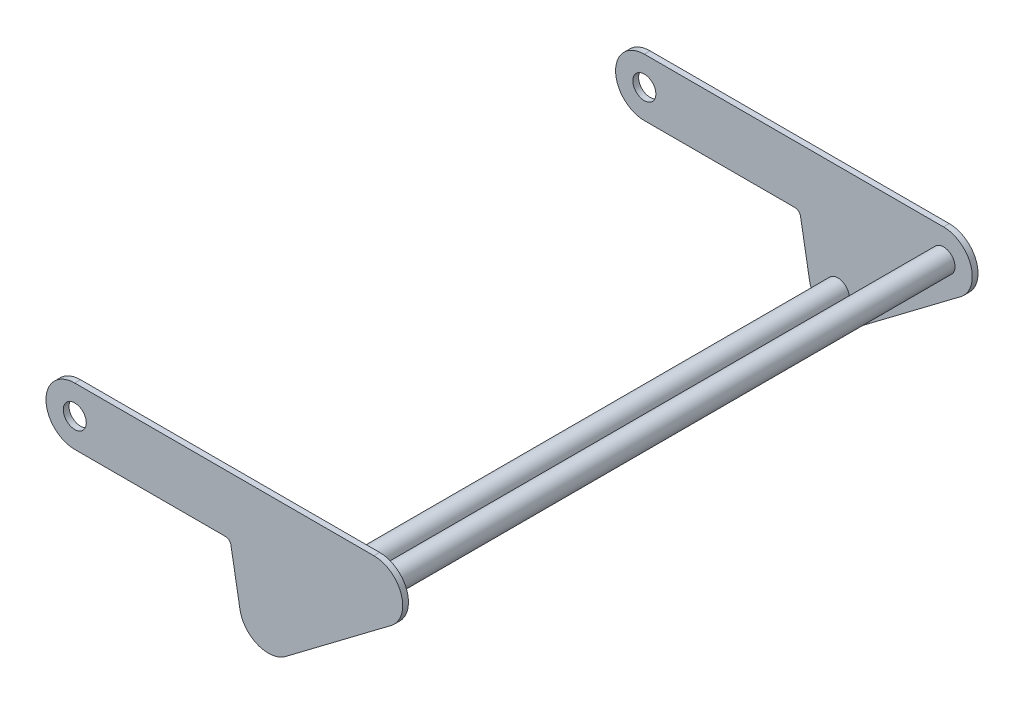
ISO-10303-21;
HEADER;
FILE_DESCRIPTION(('STEP AP214'),'2;1');
FILE_NAME('part.step','',(''),(''),'','','');
FILE_SCHEMA(('AUTOMOTIVE_DESIGN { 1 0 10303 214 1 1 1 1 }'));
ENDSEC;
DATA;
#1=APPLICATION_CONTEXT('core data for automotive mechanical design processes');
#2=APPLICATION_PROTOCOL_DEFINITION('international standard','automotive_design',2000,#1);
#3=PRODUCT_CONTEXT('',#1,'mechanical');
#4=PRODUCT('Part','Part','',(#3));
#5=PRODUCT_RELATED_PRODUCT_CATEGORY('part','',(#4));
#6=PRODUCT_DEFINITION_FORMATION('','',#4);
#7=PRODUCT_DEFINITION_CONTEXT('part definition',#1,'design');
#8=PRODUCT_DEFINITION('design','',#6,#7);
#9=PRODUCT_DEFINITION_SHAPE('','',#8);
#10=(LENGTH_UNIT() NAMED_UNIT(*) SI_UNIT(.MILLI.,.METRE.));
#11=(NAMED_UNIT(*) PLANE_ANGLE_UNIT() SI_UNIT($,.RADIAN.));
#12=(NAMED_UNIT(*) SI_UNIT($,.STERADIAN.) SOLID_ANGLE_UNIT());
#13=UNCERTAINTY_MEASURE_WITH_UNIT(LENGTH_MEASURE(1.E-05),#10,'distance_accuracy_value','');
#14=(GEOMETRIC_REPRESENTATION_CONTEXT(3) GLOBAL_UNCERTAINTY_ASSIGNED_CONTEXT((#13)) GLOBAL_UNIT_ASSIGNED_CONTEXT((#10,
#11,#12)) REPRESENTATION_CONTEXT('',''));
#15=CARTESIAN_POINT('',(0.,0.,0.));
#16=DIRECTION('',(0.,0.,1.));
#17=DIRECTION('',(1.,0.,0.));
#18=AXIS2_PLACEMENT_3D('',#15,#16,#17);
#19=CARTESIAN_POINT('',(0.,31.75,317.5));
#20=DIRECTION('',(0.,0.,-1.));
#21=DIRECTION('',(-1.,0.,0.));
#22=AXIS2_PLACEMENT_3D('',#19,#20,#21);
#23=CYLINDRICAL_SURFACE('',#22,31.75);
#24=CARTESIAN_POINT('',(0.,31.75,-311.15));
#25=DIRECTION('',(0.,0.,-1.));
#26=DIRECTION('',(-1.,0.,0.));
#27=AXIS2_PLACEMENT_3D('',#24,#25,#26);
#28=CIRCLE('',#27,31.75);
#29=CARTESIAN_POINT('',(0.,0.,-311.15));
#30=VERTEX_POINT('',#29);
#31=CARTESIAN_POINT('',(0.,63.5,-311.15));
#32=VERTEX_POINT('',#31);
#33=EDGE_CURVE('E69',#30,#32,#28,.T.);
#34=ORIENTED_EDGE('',*,*,#33,.T.);
#35=DIRECTION('',(0.,0.,-1.));
#36=VECTOR('',#35,1.);
#37=CARTESIAN_POINT('',(0.,63.5,317.5));
#38=LINE('',#37,#36);
#39=CARTESIAN_POINT('',(0.,63.5,-317.5));
#40=VERTEX_POINT('',#39);
#41=EDGE_CURVE('E55',#32,#40,#38,.T.);
#42=ORIENTED_EDGE('',*,*,#41,.T.);
#43=CARTESIAN_POINT('',(0.,31.75,-317.5));
#44=DIRECTION('',(0.,0.,1.));
#45=DIRECTION('',(1.,0.,0.));
#46=AXIS2_PLACEMENT_3D('',#43,#44,#45);
#47=CIRCLE('',#46,31.75);
#48=CARTESIAN_POINT('',(0.,0.,-317.5));
#49=VERTEX_POINT('',#48);
#50=EDGE_CURVE('E189',#40,#49,#47,.T.);
#51=ORIENTED_EDGE('',*,*,#50,.T.);
#52=DIRECTION('',(0.,0.,-1.));
#53=VECTOR('',#52,1.);
#54=CARTESIAN_POINT('',(0.,0.,317.5));
#55=LINE('',#54,#53);
#56=EDGE_CURVE('E188',#30,#49,#55,.T.);
#57=ORIENTED_EDGE('',*,*,#56,.F.);
#58=EDGE_LOOP('',(#34,#42,#51,#57));
#59=FACE_BOUND('',#58,.T.);
#60=ADVANCED_FACE('F51',(#59),#23,.T.);
#61=CARTESIAN_POINT('',(0.,0.,317.5));
#62=DIRECTION('',(0.,1.,0.));
#63=DIRECTION('',(0.,0.,1.));
#64=AXIS2_PLACEMENT_3D('',#61,#62,#63);
#65=PLANE('',#64);
#66=DIRECTION('',(0.,0.,-1.));
#67=VECTOR('',#66,1.);
#68=CARTESIAN_POINT('',(166.121717342024,0.,317.5));
#69=LINE('',#68,#67);
#70=CARTESIAN_POINT('',(166.121717342024,0.,-311.15));
#71=VERTEX_POINT('',#70);
#72=CARTESIAN_POINT('',(166.121717342024,0.,-317.5));
#73=VERTEX_POINT('',#72);
#74=EDGE_CURVE('E182',#71,#73,#69,.T.);
#75=ORIENTED_EDGE('',*,*,#74,.F.);
#76=DIRECTION('',(-1.,0.,0.));
#77=VECTOR('',#76,1.);
#78=CARTESIAN_POINT('',(1.77277547480469E-13,0.,-311.15));
#79=LINE('',#78,#77);
#80=EDGE_CURVE('E193',#71,#30,#79,.T.);
#81=ORIENTED_EDGE('',*,*,#80,.T.);
#82=ORIENTED_EDGE('',*,*,#56,.T.);
#83=DIRECTION('',(1.,0.,0.));
#84=VECTOR('',#83,1.);
#85=CARTESIAN_POINT('',(0.,0.,-317.5));
#86=LINE('',#85,#84);
#87=EDGE_CURVE('E183',#49,#73,#86,.T.);
#88=ORIENTED_EDGE('',*,*,#87,.T.);
#89=EDGE_LOOP('',(#75,#81,#82,#88));
#90=FACE_BOUND('',#89,.T.);
#91=ADVANCED_FACE('F368',(#90),#65,.F.);
#92=CARTESIAN_POINT('',(166.121717342024,-6.35,317.5));
#93=DIRECTION('',(0.,0.,-1.));
#94=DIRECTION('',(-1.,0.,0.));
#95=AXIS2_PLACEMENT_3D('',#92,#93,#94);
#96=CYLINDRICAL_SURFACE('',#95,6.34999999999999);
#97=DIRECTION('',(0.,0.,-1.));
#98=VECTOR('',#97,1.);
#99=CARTESIAN_POINT('',(172.375246573652,-5.24733407181497,317.5));
#100=LINE('',#99,#98);
#101=CARTESIAN_POINT('',(172.375246573652,-5.24733407181497,-311.15));
#102=VERTEX_POINT('',#101);
#103=CARTESIAN_POINT('',(172.375246573652,-5.24733407181497,-317.5));
#104=VERTEX_POINT('',#103);
#105=EDGE_CURVE('E177',#102,#104,#100,.T.);
#106=ORIENTED_EDGE('',*,*,#105,.F.);
#107=CARTESIAN_POINT('',(166.121717342024,-6.35,-311.15));
#108=DIRECTION('',(0.,0.,-1.));
#109=DIRECTION('',(-1.,0.,0.));
#110=AXIS2_PLACEMENT_3D('',#107,#108,#109);
#111=CIRCLE('',#110,6.34999999999999);
#112=EDGE_CURVE('E187',#102,#71,#111,.F.);
#113=ORIENTED_EDGE('',*,*,#112,.T.);
#114=ORIENTED_EDGE('',*,*,#74,.T.);
#115=CARTESIAN_POINT('',(166.121717342024,-6.35,-317.5));
#116=DIRECTION('',(0.,0.,-1.));
#117=DIRECTION('',(-1.,0.,0.));
#118=AXIS2_PLACEMENT_3D('',#115,#116,#117);
#119=CIRCLE('',#118,6.34999999999999);
#120=EDGE_CURVE('E178',#73,#104,#119,.T.);
#121=ORIENTED_EDGE('',*,*,#120,.T.);
#122=EDGE_LOOP('',(#106,#113,#114,#121));
#123=FACE_BOUND('',#122,.T.);
#124=ADVANCED_FACE('F220',(#123),#96,.F.);
#125=CARTESIAN_POINT('',(182.331323932564,-61.7110545921189,317.5));
#126=DIRECTION('',(0.984807753012207,0.173648177666934,0.));
#127=DIRECTION('',(-0.173648177666934,0.984807753012208,0.));
#128=AXIS2_PLACEMENT_3D('',#125,#126,#127);
#129=PLANE('',#128);
#130=DIRECTION('',(0.,0.,-1.));
#131=VECTOR('',#130,1.);
#132=CARTESIAN_POINT('',(182.331323932564,-61.7110545921189,317.5));
#133=LINE('',#132,#131);
#134=CARTESIAN_POINT('',(182.331323932564,-61.7110545921189,-311.15));
#135=VERTEX_POINT('',#134);
#136=CARTESIAN_POINT('',(182.331323932564,-61.7110545921189,-317.5));
#137=VERTEX_POINT('',#136);
#138=EDGE_CURVE('E130',#135,#137,#133,.T.);
#139=ORIENTED_EDGE('',*,*,#138,.F.);
#140=DIRECTION('',(-0.173648177666934,0.984807753012208,0.));
#141=VECTOR('',#140,1.);
#142=CARTESIAN_POINT('',(182.331323932564,-61.7110545921189,-311.15));
#143=LINE('',#142,#141);
#144=EDGE_CURVE('E125',#135,#102,#143,.T.);
#145=ORIENTED_EDGE('',*,*,#144,.T.);
#146=ORIENTED_EDGE('',*,*,#105,.T.);
#147=DIRECTION('',(0.173648177666934,-0.984807753012207,0.));
#148=VECTOR('',#147,1.);
#149=CARTESIAN_POINT('',(182.331323932564,-61.7110545921189,-317.5));
#150=LINE('',#149,#148);
#151=EDGE_CURVE('E140',#104,#137,#150,.T.);
#152=ORIENTED_EDGE('',*,*,#151,.T.);
#153=EDGE_LOOP('',(#139,#145,#146,#152));
#154=FACE_BOUND('',#153,.T.);
#155=ADVANCED_FACE('F216',(#154),#129,.F.);
#156=CARTESIAN_POINT('',(349.319070641564,6.40195001971773,317.5));
#157=DIRECTION('',(-0.602175453277602,0.79836377890653,0.));
#158=DIRECTION('',(-0.79836377890653,-0.602175453277602,0.));
#159=AXIS2_PLACEMENT_3D('',#156,#157,#158);
#160=PLANE('',#159);
#161=DIRECTION('',(0.,0.,-1.));
#162=VECTOR('',#161,1.);
#163=CARTESIAN_POINT('',(349.319070641564,6.40195001971773,317.5));
#164=LINE('',#163,#162);
#165=CARTESIAN_POINT('',(349.319070641564,6.40195001971773,-311.15));
#166=VERTEX_POINT('',#165);
#167=CARTESIAN_POINT('',(349.319070641564,6.40195001971773,-317.5));
#168=VERTEX_POINT('',#167);
#169=EDGE_CURVE('E138',#166,#168,#164,.T.);
#170=ORIENTED_EDGE('',*,*,#169,.F.);
#171=DIRECTION('',(-0.79836377890653,-0.602175453277602,0.));
#172=VECTOR('',#171,1.);
#173=CARTESIAN_POINT('',(349.319070641564,6.40195001971782,-311.15));
#174=LINE('',#173,#172);
#175=CARTESIAN_POINT('',(232.718040732265,-81.5457749314761,-311.15));
#176=VERTEX_POINT('',#175);
#177=EDGE_CURVE('E122',#166,#176,#174,.T.);
#178=ORIENTED_EDGE('',*,*,#177,.T.);
#179=DIRECTION('',(0.,0.,-1.));
#180=VECTOR('',#179,1.);
#181=CARTESIAN_POINT('',(232.718040732265,-81.5457749314761,317.5));
#182=LINE('',#181,#180);
#183=CARTESIAN_POINT('',(232.718040732265,-81.5457749314761,-317.5));
#184=VERTEX_POINT('',#183);
#185=EDGE_CURVE('E136',#176,#184,#182,.T.);
#186=ORIENTED_EDGE('',*,*,#185,.T.);
#187=DIRECTION('',(0.79836377890653,0.602175453277602,0.));
#188=VECTOR('',#187,1.);
#189=CARTESIAN_POINT('',(349.319070641564,6.40195001971773,-317.5));
#190=LINE('',#189,#188);
#191=EDGE_CURVE('E147',#184,#168,#190,.T.);
#192=ORIENTED_EDGE('',*,*,#191,.T.);
#193=EDGE_LOOP('',(#170,#178,#186,#192));
#194=FACE_BOUND('',#193,.T.);
#195=ADVANCED_FACE('F134',(#194),#160,.F.);
#196=CARTESIAN_POINT('',(330.2,31.75,317.5));
#197=DIRECTION('',(0.,0.,-1.));
#198=DIRECTION('',(-1.,0.,0.));
#199=AXIS2_PLACEMENT_3D('',#196,#197,#198);
#200=CYLINDRICAL_SURFACE('',#199,31.75);
#201=DIRECTION('',(0.,0.,-1.));
#202=VECTOR('',#201,1.);
#203=CARTESIAN_POINT('',(330.2,63.5,317.5));
#204=LINE('',#203,#202);
#205=CARTESIAN_POINT('',(330.2,63.5,-311.15));
#206=VERTEX_POINT('',#205);
#207=CARTESIAN_POINT('',(330.2,63.5,-317.5));
#208=VERTEX_POINT('',#207);
#209=EDGE_CURVE('E156',#206,#208,#204,.T.);
#210=ORIENTED_EDGE('',*,*,#209,.F.);
#211=CARTESIAN_POINT('',(330.2,31.75,-311.15));
#212=DIRECTION('',(0.,0.,-1.));
#213=DIRECTION('',(-1.,0.,0.));
#214=AXIS2_PLACEMENT_3D('',#211,#212,#213);
#215=CIRCLE('',#214,31.75);
#216=EDGE_CURVE('E76',#206,#166,#215,.T.);
#217=ORIENTED_EDGE('',*,*,#216,.T.);
#218=ORIENTED_EDGE('',*,*,#169,.T.);
#219=CARTESIAN_POINT('',(330.2,31.75,-317.5));
#220=DIRECTION('',(0.,0.,1.));
#221=DIRECTION('',(-1.,0.,0.));
#222=AXIS2_PLACEMENT_3D('',#219,#220,#221);
#223=CIRCLE('',#222,31.75);
#224=EDGE_CURVE('E155',#168,#208,#223,.T.);
#225=ORIENTED_EDGE('',*,*,#224,.T.);
#226=EDGE_LOOP('',(#210,#217,#218,#225));
#227=FACE_BOUND('',#226,.T.);
#228=ADVANCED_FACE('F381',(#227),#200,.T.);
#229=CARTESIAN_POINT('',(330.2,63.5,317.5));
#230=DIRECTION('',(0.,-1.,0.));
#231=DIRECTION('',(1.,0.,0.));
#232=AXIS2_PLACEMENT_3D('',#229,#230,#231);
#233=PLANE('',#232);
#234=ORIENTED_EDGE('',*,*,#41,.F.);
#235=DIRECTION('',(-1.,0.,0.));
#236=VECTOR('',#235,1.);
#237=CARTESIAN_POINT('',(-31.75,63.5,-311.15));
#238=LINE('',#237,#236);
#239=EDGE_CURVE('E11',#206,#32,#238,.T.);
#240=ORIENTED_EDGE('',*,*,#239,.F.);
#241=ORIENTED_EDGE('',*,*,#209,.T.);
#242=DIRECTION('',(-1.,0.,0.));
#243=VECTOR('',#242,1.);
#244=CARTESIAN_POINT('',(330.2,63.5,-317.5));
#245=LINE('',#244,#243);
#246=EDGE_CURVE('E158',#208,#40,#245,.T.);
#247=ORIENTED_EDGE('',*,*,#246,.T.);
#248=EDGE_LOOP('',(#234,#240,#241,#247));
#249=FACE_BOUND('',#248,.T.);
#250=ADVANCED_FACE('F228',(#249),#233,.F.);
#251=CARTESIAN_POINT('',(0.,31.75,317.5));
#252=DIRECTION('',(0.,0.,-1.));
#253=DIRECTION('',(-1.,0.,0.));
#254=AXIS2_PLACEMENT_3D('',#251,#252,#253);
#255=CYLINDRICAL_SURFACE('',#254,12.7);
#256=CARTESIAN_POINT('',(0.,31.75,-311.15));
#257=DIRECTION('',(0.,0.,-1.));
#258=DIRECTION('',(-1.,0.,0.));
#259=AXIS2_PLACEMENT_3D('',#256,#257,#258);
#260=CIRCLE('',#259,12.7);
#261=CARTESIAN_POINT('',(-12.7,31.75,-311.15));
#262=VERTEX_POINT('',#261);
#263=EDGE_CURVE('E61',#262,#262,#260,.T.);
#264=ORIENTED_EDGE('',*,*,#263,.F.);
#265=EDGE_LOOP('',(#264));
#266=FACE_BOUND('',#265,.T.);
#267=CARTESIAN_POINT('',(0.,31.75,-317.5));
#268=DIRECTION('',(0.,0.,1.));
#269=DIRECTION('',(1.,0.,0.));
#270=AXIS2_PLACEMENT_3D('',#267,#268,#269);
#271=CIRCLE('',#270,12.7);
#272=CARTESIAN_POINT('',(12.7,31.75,-317.5));
#273=VERTEX_POINT('',#272);
#274=EDGE_CURVE('E131',#273,#273,#271,.T.);
#275=ORIENTED_EDGE('',*,*,#274,.F.);
#276=EDGE_LOOP('',(#275));
#277=FACE_BOUND('',#276,.T.);
#278=ADVANCED_FACE('F53',(#266,#277),#255,.F.);
#279=CARTESIAN_POINT('',(0.,31.75,-317.5));
#280=DIRECTION('',(0.,0.,1.));
#281=DIRECTION('',(1.,0.,0.));
#282=AXIS2_PLACEMENT_3D('',#279,#280,#281);
#283=PLANE('',#282);
#284=ORIENTED_EDGE('',*,*,#50,.F.);
#285=ORIENTED_EDGE('',*,*,#246,.F.);
#286=ORIENTED_EDGE('',*,*,#224,.F.);
#287=ORIENTED_EDGE('',*,*,#191,.F.);
#288=CARTESIAN_POINT('',(213.598970090701,-56.1977249511938,-317.5));
#289=DIRECTION('',(0.,0.,1.));
#290=DIRECTION('',(-1.,0.,0.));
#291=AXIS2_PLACEMENT_3D('',#288,#289,#290);
#292=CIRCLE('',#291,31.75);
#293=EDGE_CURVE('E144',#137,#184,#292,.T.);
#294=ORIENTED_EDGE('',*,*,#293,.F.);
#295=ORIENTED_EDGE('',*,*,#151,.F.);
#296=ORIENTED_EDGE('',*,*,#120,.F.);
#297=ORIENTED_EDGE('',*,*,#87,.F.);
#298=EDGE_LOOP('',(#284,#285,#286,#287,#294,#295,#296,#297));
#299=FACE_BOUND('',#298,.T.);
#300=ORIENTED_EDGE('',*,*,#274,.T.);
#301=EDGE_LOOP('',(#300));
#302=FACE_BOUND('',#301,.T.);
#303=ADVANCED_FACE('F225',(#299,#302),#283,.F.);
#304=CARTESIAN_POINT('',(213.598970090701,-56.1977249511938,317.5));
#305=DIRECTION('',(0.,0.,-1.));
#306=DIRECTION('',(-1.,0.,0.));
#307=AXIS2_PLACEMENT_3D('',#304,#305,#306);
#308=CYLINDRICAL_SURFACE('',#307,31.75);
#309=CARTESIAN_POINT('',(213.598970090701,-56.1977249511938,-311.15));
#310=DIRECTION('',(0.,0.,-1.));
#311=DIRECTION('',(-1.,0.,0.));
#312=AXIS2_PLACEMENT_3D('',#309,#310,#311);
#313=CIRCLE('',#312,31.75);
#314=EDGE_CURVE('E119',#176,#135,#313,.T.);
#315=ORIENTED_EDGE('',*,*,#314,.T.);
#316=ORIENTED_EDGE('',*,*,#138,.T.);
#317=ORIENTED_EDGE('',*,*,#293,.T.);
#318=ORIENTED_EDGE('',*,*,#185,.F.);
#319=EDGE_LOOP('',(#315,#316,#317,#318));
#320=FACE_BOUND('',#319,.T.);
#321=ADVANCED_FACE('F142',(#320),#308,.T.);
#322=CARTESIAN_POINT('',(-31.75,-87.9477249511938,-311.15));
#323=DIRECTION('',(0.,0.,-1.));
#324=DIRECTION('',(-1.,0.,0.));
#325=AXIS2_PLACEMENT_3D('',#322,#323,#324);
#326=PLANE('',#325);
#327=CARTESIAN_POINT('',(213.598970090701,-56.1977249511938,-311.15));
#328=DIRECTION('',(0.,0.,-1.));
#329=DIRECTION('',(-1.,0.,0.));
#330=AXIS2_PLACEMENT_3D('',#327,#328,#329);
#331=CIRCLE('',#330,12.7);
#332=CARTESIAN_POINT('',(200.898970090701,-56.1977249511938,-311.15));
#333=VERTEX_POINT('',#332);
#334=EDGE_CURVE('E345',#333,#333,#331,.F.);
#335=ORIENTED_EDGE('',*,*,#334,.F.);
#336=EDGE_LOOP('',(#335));
#337=FACE_BOUND('',#336,.T.);
#338=CARTESIAN_POINT('',(330.2,31.75,-311.15));
#339=DIRECTION('',(0.,0.,-1.));
#340=DIRECTION('',(-1.,0.,0.));
#341=AXIS2_PLACEMENT_3D('',#338,#339,#340);
#342=CIRCLE('',#341,12.7);
#343=CARTESIAN_POINT('',(317.5,31.75,-311.15));
#344=VERTEX_POINT('',#343);
#345=EDGE_CURVE('E199',#344,#344,#342,.F.);
#346=ORIENTED_EDGE('',*,*,#345,.F.);
#347=EDGE_LOOP('',(#346));
#348=FACE_BOUND('',#347,.T.);
#349=ORIENTED_EDGE('',*,*,#263,.T.);
#350=EDGE_LOOP('',(#349));
#351=FACE_BOUND('',#350,.T.);
#352=ORIENTED_EDGE('',*,*,#33,.F.);
#353=ORIENTED_EDGE('',*,*,#80,.F.);
#354=ORIENTED_EDGE('',*,*,#112,.F.);
#355=ORIENTED_EDGE('',*,*,#144,.F.);
#356=ORIENTED_EDGE('',*,*,#314,.F.);
#357=ORIENTED_EDGE('',*,*,#177,.F.);
#358=ORIENTED_EDGE('',*,*,#216,.F.);
#359=ORIENTED_EDGE('',*,*,#239,.T.);
#360=EDGE_LOOP('',(#352,#353,#354,#355,#356,#357,#358,#359));
#361=FACE_BOUND('',#360,.T.);
#362=ADVANCED_FACE('F121',(#337,#348,#351,#361),#326,.F.);
#363=CARTESIAN_POINT('',(330.2,31.75,-317.502));
#364=DIRECTION('',(0.,0.,1.));
#365=DIRECTION('',(1.,0.,0.));
#366=AXIS2_PLACEMENT_3D('',#363,#364,#365);
#367=CYLINDRICAL_SURFACE('',#366,12.7);
#368=ORIENTED_EDGE('',*,*,#345,.T.);
#369=EDGE_LOOP('',(#368));
#370=FACE_BOUND('',#369,.T.);
#371=CARTESIAN_POINT('',(330.2,31.75,311.15));
#372=DIRECTION('',(0.,0.,1.));
#373=DIRECTION('',(1.,0.,0.));
#374=AXIS2_PLACEMENT_3D('',#371,#372,#373);
#375=CIRCLE('',#374,12.7);
#376=CARTESIAN_POINT('',(342.9,31.75,311.15));
#377=VERTEX_POINT('',#376);
#378=EDGE_CURVE('E233',#377,#377,#375,.T.);
#379=ORIENTED_EDGE('',*,*,#378,.F.);
#380=EDGE_LOOP('',(#379));
#381=FACE_BOUND('',#380,.T.);
#382=ADVANCED_FACE('F386',(#370,#381),#367,.T.);
#383=CARTESIAN_POINT('',(330.2,63.5,317.5));
#384=DIRECTION('',(0.,-1.,0.));
#385=DIRECTION('',(1.,0.,0.));
#386=AXIS2_PLACEMENT_3D('',#383,#384,#385);
#387=PLANE('',#386);
#388=DIRECTION('',(0.,0.,-1.));
#389=VECTOR('',#388,1.);
#390=CARTESIAN_POINT('',(330.2,63.5,317.5));
#391=LINE('',#390,#389);
#392=CARTESIAN_POINT('',(330.2,63.5,317.5));
#393=VERTEX_POINT('',#392);
#394=CARTESIAN_POINT('',(330.2,63.5000000000001,311.15));
#395=VERTEX_POINT('',#394);
#396=EDGE_CURVE('E261',#393,#395,#391,.T.);
#397=ORIENTED_EDGE('',*,*,#396,.T.);
#398=DIRECTION('',(1.,0.,0.));
#399=VECTOR('',#398,1.);
#400=CARTESIAN_POINT('',(-31.75,63.5,311.15));
#401=LINE('',#400,#399);
#402=CARTESIAN_POINT('',(0.,63.5,311.15));
#403=VERTEX_POINT('',#402);
#404=EDGE_CURVE('E337',#403,#395,#401,.T.);
#405=ORIENTED_EDGE('',*,*,#404,.F.);
#406=DIRECTION('',(0.,0.,-1.));
#407=VECTOR('',#406,1.);
#408=CARTESIAN_POINT('',(0.,63.5,317.5));
#409=LINE('',#408,#407);
#410=CARTESIAN_POINT('',(0.,63.5,317.5));
#411=VERTEX_POINT('',#410);
#412=EDGE_CURVE('E265',#411,#403,#409,.T.);
#413=ORIENTED_EDGE('',*,*,#412,.F.);
#414=DIRECTION('',(-1.,0.,0.));
#415=VECTOR('',#414,1.);
#416=CARTESIAN_POINT('',(330.2,63.5,317.5));
#417=LINE('',#416,#415);
#418=EDGE_CURVE('E269',#393,#411,#417,.T.);
#419=ORIENTED_EDGE('',*,*,#418,.F.);
#420=EDGE_LOOP('',(#397,#405,#413,#419));
#421=FACE_BOUND('',#420,.T.);
#422=ADVANCED_FACE('F391',(#421),#387,.F.);
#423=CARTESIAN_POINT('',(330.2,31.75,317.5));
#424=DIRECTION('',(0.,0.,-1.));
#425=DIRECTION('',(-1.,0.,0.));
#426=AXIS2_PLACEMENT_3D('',#423,#424,#425);
#427=CYLINDRICAL_SURFACE('',#426,31.75);
#428=CARTESIAN_POINT('',(330.2,31.75,311.15));
#429=DIRECTION('',(0.,0.,1.));
#430=DIRECTION('',(1.,0.,0.));
#431=AXIS2_PLACEMENT_3D('',#428,#429,#430);
#432=CIRCLE('',#431,31.75);
#433=CARTESIAN_POINT('',(349.319070641564,6.40195001971773,311.15));
#434=VERTEX_POINT('',#433);
#435=EDGE_CURVE('E329',#434,#395,#432,.T.);
#436=ORIENTED_EDGE('',*,*,#435,.T.);
#437=ORIENTED_EDGE('',*,*,#396,.F.);
#438=CARTESIAN_POINT('',(330.2,31.75,317.5));
#439=DIRECTION('',(0.,0.,1.));
#440=DIRECTION('',(-1.,0.,0.));
#441=AXIS2_PLACEMENT_3D('',#438,#439,#440);
#442=CIRCLE('',#441,31.75);
#443=CARTESIAN_POINT('',(349.319070641564,6.40195001971773,317.5));
#444=VERTEX_POINT('',#443);
#445=EDGE_CURVE('E273',#444,#393,#442,.T.);
#446=ORIENTED_EDGE('',*,*,#445,.F.);
#447=DIRECTION('',(0.,0.,-1.));
#448=VECTOR('',#447,1.);
#449=CARTESIAN_POINT('',(349.319070641564,6.40195001971773,317.5));
#450=LINE('',#449,#448);
#451=EDGE_CURVE('E257',#444,#434,#450,.T.);
#452=ORIENTED_EDGE('',*,*,#451,.T.);
#453=EDGE_LOOP('',(#436,#437,#446,#452));
#454=FACE_BOUND('',#453,.T.);
#455=ADVANCED_FACE('F422',(#454),#427,.T.);
#456=CARTESIAN_POINT('',(349.319070641564,6.40195001971773,317.5));
#457=DIRECTION('',(-0.602175453277602,0.79836377890653,0.));
#458=DIRECTION('',(-0.79836377890653,-0.602175453277602,0.));
#459=AXIS2_PLACEMENT_3D('',#456,#457,#458);
#460=PLANE('',#459);
#461=DIRECTION('',(0.,0.,-1.));
#462=VECTOR('',#461,1.);
#463=CARTESIAN_POINT('',(232.718040732265,-81.5457749314761,317.5));
#464=LINE('',#463,#462);
#465=CARTESIAN_POINT('',(232.718040732265,-81.5457749314761,317.5));
#466=VERTEX_POINT('',#465);
#467=CARTESIAN_POINT('',(232.718040732265,-81.5457749314761,311.15));
#468=VERTEX_POINT('',#467);
#469=EDGE_CURVE('E253',#466,#468,#464,.T.);
#470=ORIENTED_EDGE('',*,*,#469,.T.);
#471=DIRECTION('',(0.79836377890653,0.602175453277602,0.));
#472=VECTOR('',#471,1.);
#473=CARTESIAN_POINT('',(349.319070641564,6.40195001971773,311.15));
#474=LINE('',#473,#472);
#475=EDGE_CURVE('E325',#468,#434,#474,.T.);
#476=ORIENTED_EDGE('',*,*,#475,.T.);
#477=ORIENTED_EDGE('',*,*,#451,.F.);
#478=DIRECTION('',(0.79836377890653,0.602175453277602,0.));
#479=VECTOR('',#478,1.);
#480=CARTESIAN_POINT('',(349.319070641564,6.40195001971773,317.5));
#481=LINE('',#480,#479);
#482=EDGE_CURVE('E277',#466,#444,#481,.T.);
#483=ORIENTED_EDGE('',*,*,#482,.F.);
#484=EDGE_LOOP('',(#470,#476,#477,#483));
#485=FACE_BOUND('',#484,.T.);
#486=ADVANCED_FACE('F461',(#485),#460,.F.);
#487=CARTESIAN_POINT('',(213.598970090701,-56.1977249511938,317.5));
#488=DIRECTION('',(0.,0.,-1.));
#489=DIRECTION('',(-1.,0.,0.));
#490=AXIS2_PLACEMENT_3D('',#487,#488,#489);
#491=CYLINDRICAL_SURFACE('',#490,31.75);
#492=CARTESIAN_POINT('',(213.598970090701,-56.1977249511938,311.15));
#493=DIRECTION('',(0.,0.,1.));
#494=DIRECTION('',(1.,0.,0.));
#495=AXIS2_PLACEMENT_3D('',#492,#493,#494);
#496=CIRCLE('',#495,31.75);
#497=CARTESIAN_POINT('',(182.331323932564,-61.7110545921189,311.15));
#498=VERTEX_POINT('',#497);
#499=EDGE_CURVE('E321',#498,#468,#496,.T.);
#500=ORIENTED_EDGE('',*,*,#499,.T.);
#501=ORIENTED_EDGE('',*,*,#469,.F.);
#502=CARTESIAN_POINT('',(213.598970090701,-56.1977249511938,317.5));
#503=DIRECTION('',(0.,0.,1.));
#504=DIRECTION('',(-1.,0.,0.));
#505=AXIS2_PLACEMENT_3D('',#502,#503,#504);
#506=CIRCLE('',#505,31.75);
#507=CARTESIAN_POINT('',(182.331323932564,-61.7110545921189,317.5));
#508=VERTEX_POINT('',#507);
#509=EDGE_CURVE('E281',#508,#466,#506,.T.);
#510=ORIENTED_EDGE('',*,*,#509,.F.);
#511=DIRECTION('',(0.,0.,-1.));
#512=VECTOR('',#511,1.);
#513=CARTESIAN_POINT('',(182.331323932564,-61.7110545921189,317.5));
#514=LINE('',#513,#512);
#515=EDGE_CURVE('E249',#508,#498,#514,.T.);
#516=ORIENTED_EDGE('',*,*,#515,.T.);
#517=EDGE_LOOP('',(#500,#501,#510,#516));
#518=FACE_BOUND('',#517,.T.);
#519=ADVANCED_FACE('F455',(#518),#491,.T.);
#520=CARTESIAN_POINT('',(182.331323932564,-61.7110545921189,317.5));
#521=DIRECTION('',(0.984807753012207,0.173648177666934,0.));
#522=DIRECTION('',(-0.173648177666934,0.984807753012208,0.));
#523=AXIS2_PLACEMENT_3D('',#520,#521,#522);
#524=PLANE('',#523);
#525=DIRECTION('',(0.,0.,-1.));
#526=VECTOR('',#525,1.);
#527=CARTESIAN_POINT('',(172.375246573652,-5.24733407181497,317.5));
#528=LINE('',#527,#526);
#529=CARTESIAN_POINT('',(172.375246573652,-5.24733407181497,317.5));
#530=VERTEX_POINT('',#529);
#531=CARTESIAN_POINT('',(172.375246573652,-5.24733407181497,311.15));
#532=VERTEX_POINT('',#531);
#533=EDGE_CURVE('E245',#530,#532,#528,.T.);
#534=ORIENTED_EDGE('',*,*,#533,.T.);
#535=DIRECTION('',(0.173648177666934,-0.984807753012208,0.));
#536=VECTOR('',#535,1.);
#537=CARTESIAN_POINT('',(182.331323932564,-61.7110545921189,311.15));
#538=LINE('',#537,#536);
#539=EDGE_CURVE('E317',#532,#498,#538,.T.);
#540=ORIENTED_EDGE('',*,*,#539,.T.);
#541=ORIENTED_EDGE('',*,*,#515,.F.);
#542=DIRECTION('',(0.173648177666934,-0.984807753012207,0.));
#543=VECTOR('',#542,1.);
#544=CARTESIAN_POINT('',(182.331323932564,-61.7110545921189,317.5));
#545=LINE('',#544,#543);
#546=EDGE_CURVE('E285',#530,#508,#545,.T.);
#547=ORIENTED_EDGE('',*,*,#546,.F.);
#548=EDGE_LOOP('',(#534,#540,#541,#547));
#549=FACE_BOUND('',#548,.T.);
#550=ADVANCED_FACE('F468',(#549),#524,.F.);
#551=CARTESIAN_POINT('',(166.121717342024,-6.35,317.5));
#552=DIRECTION('',(0.,0.,-1.));
#553=DIRECTION('',(-1.,0.,0.));
#554=AXIS2_PLACEMENT_3D('',#551,#552,#553);
#555=CYLINDRICAL_SURFACE('',#554,6.34999999999999);
#556=DIRECTION('',(0.,0.,-1.));
#557=VECTOR('',#556,1.);
#558=CARTESIAN_POINT('',(166.121717342024,0.,317.5));
#559=LINE('',#558,#557);
#560=CARTESIAN_POINT('',(166.121717342024,0.,317.5));
#561=VERTEX_POINT('',#560);
#562=CARTESIAN_POINT('',(166.121717342024,0.,311.15));
#563=VERTEX_POINT('',#562);
#564=EDGE_CURVE('E241',#561,#563,#559,.T.);
#565=ORIENTED_EDGE('',*,*,#564,.T.);
#566=CARTESIAN_POINT('',(166.121717342024,-6.35,311.15));
#567=DIRECTION('',(0.,0.,1.));
#568=DIRECTION('',(1.,0.,0.));
#569=AXIS2_PLACEMENT_3D('',#566,#567,#568);
#570=CIRCLE('',#569,6.34999999999999);
#571=EDGE_CURVE('E313',#563,#532,#570,.F.);
#572=ORIENTED_EDGE('',*,*,#571,.T.);
#573=ORIENTED_EDGE('',*,*,#533,.F.);
#574=CARTESIAN_POINT('',(166.121717342024,-6.35,317.5));
#575=DIRECTION('',(0.,0.,-1.));
#576=DIRECTION('',(-1.,0.,0.));
#577=AXIS2_PLACEMENT_3D('',#574,#575,#576);
#578=CIRCLE('',#577,6.34999999999999);
#579=EDGE_CURVE('E289',#561,#530,#578,.T.);
#580=ORIENTED_EDGE('',*,*,#579,.F.);
#581=EDGE_LOOP('',(#565,#572,#573,#580));
#582=FACE_BOUND('',#581,.T.);
#583=ADVANCED_FACE('F470',(#582),#555,.F.);
#584=CARTESIAN_POINT('',(0.,0.,317.5));
#585=DIRECTION('',(0.,1.,0.));
#586=DIRECTION('',(0.,0.,1.));
#587=AXIS2_PLACEMENT_3D('',#584,#585,#586);
#588=PLANE('',#587);
#589=DIRECTION('',(0.,0.,-1.));
#590=VECTOR('',#589,1.);
#591=CARTESIAN_POINT('',(0.,0.,317.5));
#592=LINE('',#591,#590);
#593=CARTESIAN_POINT('',(0.,0.,317.5));
#594=VERTEX_POINT('',#593);
#595=CARTESIAN_POINT('',(0.,0.,311.15));
#596=VERTEX_POINT('',#595);
#597=EDGE_CURVE('E237',#594,#596,#592,.T.);
#598=ORIENTED_EDGE('',*,*,#597,.T.);
#599=DIRECTION('',(1.,0.,0.));
#600=VECTOR('',#599,1.);
#601=CARTESIAN_POINT('',(0.,0.,311.15));
#602=LINE('',#601,#600);
#603=EDGE_CURVE('E309',#596,#563,#602,.T.);
#604=ORIENTED_EDGE('',*,*,#603,.T.);
#605=ORIENTED_EDGE('',*,*,#564,.F.);
#606=DIRECTION('',(1.,0.,0.));
#607=VECTOR('',#606,1.);
#608=CARTESIAN_POINT('',(0.,0.,317.5));
#609=LINE('',#608,#607);
#610=EDGE_CURVE('E293',#594,#561,#609,.T.);
#611=ORIENTED_EDGE('',*,*,#610,.F.);
#612=EDGE_LOOP('',(#598,#604,#605,#611));
#613=FACE_BOUND('',#612,.T.);
#614=ADVANCED_FACE('F473',(#613),#588,.F.);
#615=CARTESIAN_POINT('',(0.,31.75,317.5));
#616=DIRECTION('',(0.,0.,-1.));
#617=DIRECTION('',(-1.,0.,0.));
#618=AXIS2_PLACEMENT_3D('',#615,#616,#617);
#619=CYLINDRICAL_SURFACE('',#618,31.75);
#620=ORIENTED_EDGE('',*,*,#412,.T.);
#621=CARTESIAN_POINT('',(0.,31.75,311.15));
#622=DIRECTION('',(0.,0.,1.));
#623=DIRECTION('',(1.,0.,0.));
#624=AXIS2_PLACEMENT_3D('',#621,#622,#623);
#625=CIRCLE('',#624,31.75);
#626=EDGE_CURVE('E305',#403,#596,#625,.T.);
#627=ORIENTED_EDGE('',*,*,#626,.T.);
#628=ORIENTED_EDGE('',*,*,#597,.F.);
#629=CARTESIAN_POINT('',(0.,31.75,317.5));
#630=DIRECTION('',(0.,0.,1.));
#631=DIRECTION('',(1.,0.,0.));
#632=AXIS2_PLACEMENT_3D('',#629,#630,#631);
#633=CIRCLE('',#632,31.75);
#634=EDGE_CURVE('E297',#411,#594,#633,.T.);
#635=ORIENTED_EDGE('',*,*,#634,.F.);
#636=EDGE_LOOP('',(#620,#627,#628,#635));
#637=FACE_BOUND('',#636,.T.);
#638=ADVANCED_FACE('F477',(#637),#619,.T.);
#639=CARTESIAN_POINT('',(0.,31.75,317.5));
#640=DIRECTION('',(0.,0.,1.));
#641=DIRECTION('',(1.,0.,0.));
#642=AXIS2_PLACEMENT_3D('',#639,#640,#641);
#643=PLANE('',#642);
#644=ORIENTED_EDGE('',*,*,#634,.T.);
#645=ORIENTED_EDGE('',*,*,#610,.T.);
#646=ORIENTED_EDGE('',*,*,#579,.T.);
#647=ORIENTED_EDGE('',*,*,#546,.T.);
#648=ORIENTED_EDGE('',*,*,#509,.T.);
#649=ORIENTED_EDGE('',*,*,#482,.T.);
#650=ORIENTED_EDGE('',*,*,#445,.T.);
#651=ORIENTED_EDGE('',*,*,#418,.T.);
#652=EDGE_LOOP('',(#644,#645,#646,#647,#648,#649,#650,#651));
#653=FACE_BOUND('',#652,.T.);
#654=CARTESIAN_POINT('',(0.,31.75,317.5));
#655=DIRECTION('',(0.,0.,1.));
#656=DIRECTION('',(1.,0.,0.));
#657=AXIS2_PLACEMENT_3D('',#654,#655,#656);
#658=CIRCLE('',#657,12.7);
#659=CARTESIAN_POINT('',(12.7,31.75,317.5));
#660=VERTEX_POINT('',#659);
#661=EDGE_CURVE('E301',#660,#660,#658,.T.);
#662=ORIENTED_EDGE('',*,*,#661,.F.);
#663=EDGE_LOOP('',(#662));
#664=FACE_BOUND('',#663,.T.);
#665=ADVANCED_FACE('F462',(#653,#664),#643,.T.);
#666=CARTESIAN_POINT('',(0.,31.75,317.5));
#667=DIRECTION('',(0.,0.,-1.));
#668=DIRECTION('',(-1.,0.,0.));
#669=AXIS2_PLACEMENT_3D('',#666,#667,#668);
#670=CYLINDRICAL_SURFACE('',#669,12.7);
#671=CARTESIAN_POINT('',(0.,31.75,311.15));
#672=DIRECTION('',(0.,0.,1.));
#673=DIRECTION('',(1.,0.,0.));
#674=AXIS2_PLACEMENT_3D('',#671,#672,#673);
#675=CIRCLE('',#674,12.7);
#676=CARTESIAN_POINT('',(12.7,31.75,311.15));
#677=VERTEX_POINT('',#676);
#678=EDGE_CURVE('E333',#677,#677,#675,.T.);
#679=ORIENTED_EDGE('',*,*,#678,.F.);
#680=EDGE_LOOP('',(#679));
#681=FACE_BOUND('',#680,.T.);
#682=ORIENTED_EDGE('',*,*,#661,.T.);
#683=EDGE_LOOP('',(#682));
#684=FACE_BOUND('',#683,.T.);
#685=ADVANCED_FACE('F402',(#681,#684),#670,.F.);
#686=CARTESIAN_POINT('',(-31.75,-87.9477249511938,311.15));
#687=DIRECTION('',(0.,0.,1.));
#688=DIRECTION('',(1.,0.,0.));
#689=AXIS2_PLACEMENT_3D('',#686,#687,#688);
#690=PLANE('',#689);
#691=CARTESIAN_POINT('',(213.598970090701,-56.1977249511938,311.15));
#692=DIRECTION('',(0.,0.,1.));
#693=DIRECTION('',(1.,0.,0.));
#694=AXIS2_PLACEMENT_3D('',#691,#692,#693);
#695=CIRCLE('',#694,12.7);
#696=CARTESIAN_POINT('',(226.298970090701,-56.1977249511938,311.15));
#697=VERTEX_POINT('',#696);
#698=EDGE_CURVE('E341',#697,#697,#695,.T.);
#699=ORIENTED_EDGE('',*,*,#698,.T.);
#700=EDGE_LOOP('',(#699));
#701=FACE_BOUND('',#700,.T.);
#702=ORIENTED_EDGE('',*,*,#378,.T.);
#703=EDGE_LOOP('',(#702));
#704=FACE_BOUND('',#703,.T.);
#705=ORIENTED_EDGE('',*,*,#678,.T.);
#706=EDGE_LOOP('',(#705));
#707=FACE_BOUND('',#706,.T.);
#708=ORIENTED_EDGE('',*,*,#404,.T.);
#709=ORIENTED_EDGE('',*,*,#435,.F.);
#710=ORIENTED_EDGE('',*,*,#475,.F.);
#711=ORIENTED_EDGE('',*,*,#499,.F.);
#712=ORIENTED_EDGE('',*,*,#539,.F.);
#713=ORIENTED_EDGE('',*,*,#571,.F.);
#714=ORIENTED_EDGE('',*,*,#603,.F.);
#715=ORIENTED_EDGE('',*,*,#626,.F.);
#716=EDGE_LOOP('',(#708,#709,#710,#711,#712,#713,#714,#715));
#717=FACE_BOUND('',#716,.T.);
#718=ADVANCED_FACE('F398',(#701,#704,#707,#717),#690,.F.);
#719=CARTESIAN_POINT('',(213.598970090701,-56.1977249511938,-317.502));
#720=DIRECTION('',(0.,0.,1.));
#721=DIRECTION('',(1.,0.,0.));
#722=AXIS2_PLACEMENT_3D('',#719,#720,#721);
#723=CYLINDRICAL_SURFACE('',#722,12.7);
#724=ORIENTED_EDGE('',*,*,#334,.T.);
#725=EDGE_LOOP('',(#724));
#726=FACE_BOUND('',#725,.T.);
#727=ORIENTED_EDGE('',*,*,#698,.F.);
#728=EDGE_LOOP('',(#727));
#729=FACE_BOUND('',#728,.T.);
#730=ADVANCED_FACE('F401',(#726,#729),#723,.T.);
#731=CLOSED_SHELL('',(#60,#91,#124,#155,#195,#228,#250,#278,#303,#321,#362,#382,#422,#455,#486,
#519,#550,#583,#614,#638,#665,#685,#718,#730));
#732=MANIFOLD_SOLID_BREP('B2',#731);
#733=ADVANCED_BREP_SHAPE_REPRESENTATION('',(#18,#732),#14);
#734=SHAPE_DEFINITION_REPRESENTATION(#9,#733);
ENDSEC;
END-ISO-10303-21;
